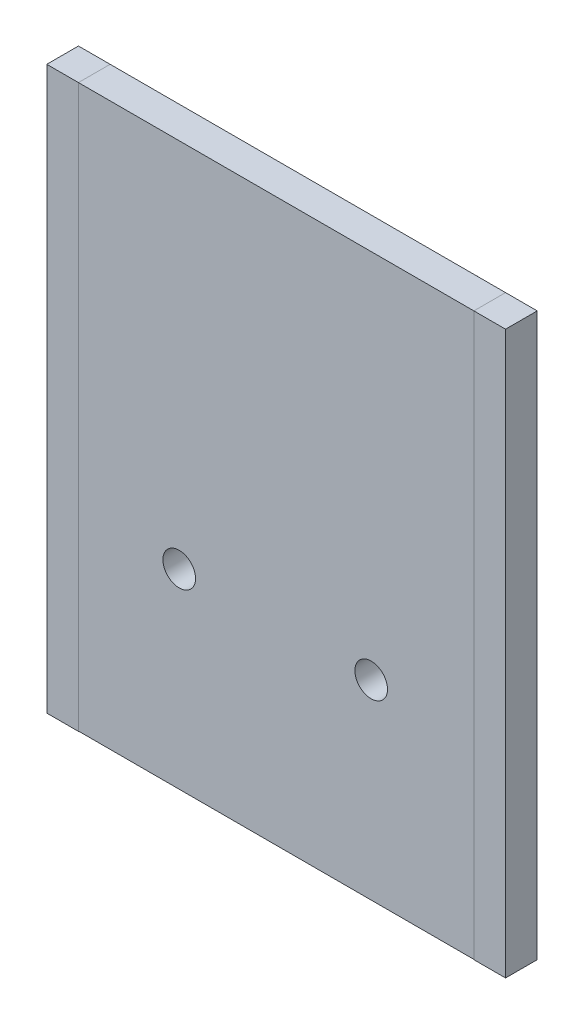
ISO-10303-21;
HEADER;
FILE_DESCRIPTION(('STEP AP214'),'2;1');
FILE_NAME('part.step','',(''),(''),'','','');
FILE_SCHEMA(('AUTOMOTIVE_DESIGN { 1 0 10303 214 1 1 1 1 }'));
ENDSEC;
DATA;
#1=APPLICATION_CONTEXT('core data for automotive mechanical design processes');
#2=APPLICATION_PROTOCOL_DEFINITION('international standard','automotive_design',2000,#1);
#3=PRODUCT_CONTEXT('',#1,'mechanical');
#4=PRODUCT('Part','Part','',(#3));
#5=PRODUCT_RELATED_PRODUCT_CATEGORY('part','',(#4));
#6=PRODUCT_DEFINITION_FORMATION('','',#4);
#7=PRODUCT_DEFINITION_CONTEXT('part definition',#1,'design');
#8=PRODUCT_DEFINITION('design','',#6,#7);
#9=PRODUCT_DEFINITION_SHAPE('','',#8);
#10=(LENGTH_UNIT() NAMED_UNIT(*) SI_UNIT(.MILLI.,.METRE.));
#11=(NAMED_UNIT(*) PLANE_ANGLE_UNIT() SI_UNIT($,.RADIAN.));
#12=(NAMED_UNIT(*) SI_UNIT($,.STERADIAN.) SOLID_ANGLE_UNIT());
#13=UNCERTAINTY_MEASURE_WITH_UNIT(LENGTH_MEASURE(1.E-05),#10,'distance_accuracy_value','');
#14=(GEOMETRIC_REPRESENTATION_CONTEXT(3) GLOBAL_UNCERTAINTY_ASSIGNED_CONTEXT((#13)) GLOBAL_UNIT_ASSIGNED_CONTEXT((#10,
#11,#12)) REPRESENTATION_CONTEXT('',''));
#15=CARTESIAN_POINT('',(0.,0.,0.));
#16=DIRECTION('',(0.,0.,1.));
#17=DIRECTION('',(1.,0.,0.));
#18=AXIS2_PLACEMENT_3D('',#15,#16,#17);
#19=CARTESIAN_POINT('',(-19.2738419618529,-28.655507896759,-3.3));
#20=DIRECTION('',(0.,1.,0.));
#21=DIRECTION('',(0.,0.,1.));
#22=AXIS2_PLACEMENT_3D('',#19,#20,#21);
#23=PLANE('',#22);
#24=DIRECTION('',(-1.,0.,0.));
#25=VECTOR('',#24,1.);
#26=CARTESIAN_POINT('',(-19.2738419618529,-28.655507896759,0.));
#27=LINE('',#26,#25);
#28=CARTESIAN_POINT('',(-19.2738419618529,-28.655507896759,0.));
#29=VERTEX_POINT('',#28);
#30=CARTESIAN_POINT('',(-22.5738419618529,-28.655507896759,0.));
#31=VERTEX_POINT('',#30);
#32=EDGE_CURVE('E13',#29,#31,#27,.T.);
#33=ORIENTED_EDGE('',*,*,#32,.T.);
#34=DIRECTION('',(0.,0.,1.));
#35=VECTOR('',#34,1.);
#36=CARTESIAN_POINT('',(-22.5738419618529,-28.655507896759,-3.3));
#37=LINE('',#36,#35);
#38=CARTESIAN_POINT('',(-22.5738419618529,-28.655507896759,-3.3));
#39=VERTEX_POINT('',#38);
#40=EDGE_CURVE('E111',#39,#31,#37,.T.);
#41=ORIENTED_EDGE('',*,*,#40,.F.);
#42=DIRECTION('',(-1.,0.,0.));
#43=VECTOR('',#42,1.);
#44=CARTESIAN_POINT('',(-19.2738419618529,-28.655507896759,-3.3));
#45=LINE('',#44,#43);
#46=CARTESIAN_POINT('',(-19.2738419618529,-28.655507896759,-3.3));
#47=VERTEX_POINT('',#46);
#48=EDGE_CURVE('E96',#47,#39,#45,.T.);
#49=ORIENTED_EDGE('',*,*,#48,.F.);
#50=DIRECTION('',(0.,0.,1.));
#51=VECTOR('',#50,1.);
#52=CARTESIAN_POINT('',(-19.2738419618529,-28.655507896759,-3.3));
#53=LINE('',#52,#51);
#54=EDGE_CURVE('E146',#47,#29,#53,.T.);
#55=ORIENTED_EDGE('',*,*,#54,.T.);
#56=EDGE_LOOP('',(#33,#41,#49,#55));
#57=FACE_BOUND('',#56,.T.);
#58=ADVANCED_FACE('F92',(#57),#23,.F.);
#59=CARTESIAN_POINT('',(-22.5738419618529,29.8889645776567,-3.3));
#60=DIRECTION('',(-1.,0.,0.));
#61=DIRECTION('',(0.,-1.,0.));
#62=AXIS2_PLACEMENT_3D('',#59,#60,#61);
#63=PLANE('',#62);
#64=DIRECTION('',(0.,-1.,0.));
#65=VECTOR('',#64,1.);
#66=CARTESIAN_POINT('',(-22.5738419618529,29.8889645776567,0.));
#67=LINE('',#66,#65);
#68=CARTESIAN_POINT('',(-22.5738419618529,29.8889645776567,0.));
#69=VERTEX_POINT('',#68);
#70=EDGE_CURVE('E102',#69,#31,#67,.T.);
#71=ORIENTED_EDGE('',*,*,#70,.F.);
#72=DIRECTION('',(0.,0.,1.));
#73=VECTOR('',#72,1.);
#74=CARTESIAN_POINT('',(-22.5738419618529,29.8889645776567,-3.3));
#75=LINE('',#74,#73);
#76=CARTESIAN_POINT('',(-22.5738419618529,29.8889645776567,-3.3));
#77=VERTEX_POINT('',#76);
#78=EDGE_CURVE('E124',#77,#69,#75,.T.);
#79=ORIENTED_EDGE('',*,*,#78,.F.);
#80=DIRECTION('',(0.,-1.,0.));
#81=VECTOR('',#80,1.);
#82=CARTESIAN_POINT('',(-22.5738419618529,29.8889645776567,-3.3));
#83=LINE('',#82,#81);
#84=EDGE_CURVE('E162',#77,#39,#83,.T.);
#85=ORIENTED_EDGE('',*,*,#84,.T.);
#86=ORIENTED_EDGE('',*,*,#40,.T.);
#87=EDGE_LOOP('',(#71,#79,#85,#86));
#88=FACE_BOUND('',#87,.T.);
#89=ADVANCED_FACE('F163',(#88),#63,.T.);
#90=CARTESIAN_POINT('',(-19.2738419618529,29.8889645776567,-3.3));
#91=DIRECTION('',(0.,1.,0.));
#92=DIRECTION('',(0.,0.,1.));
#93=AXIS2_PLACEMENT_3D('',#90,#91,#92);
#94=PLANE('',#93);
#95=DIRECTION('',(-1.,0.,0.));
#96=VECTOR('',#95,1.);
#97=CARTESIAN_POINT('',(-19.2738419618529,29.8889645776567,0.));
#98=LINE('',#97,#96);
#99=CARTESIAN_POINT('',(-19.2738419618529,29.8889645776567,0.));
#100=VERTEX_POINT('',#99);
#101=EDGE_CURVE('E153',#100,#69,#98,.T.);
#102=ORIENTED_EDGE('',*,*,#101,.F.);
#103=DIRECTION('',(0.,0.,1.));
#104=VECTOR('',#103,1.);
#105=CARTESIAN_POINT('',(-19.2738419618529,29.8889645776567,-3.3));
#106=LINE('',#105,#104);
#107=CARTESIAN_POINT('',(-19.2738419618529,29.8889645776567,-3.3));
#108=VERTEX_POINT('',#107);
#109=EDGE_CURVE('E139',#108,#100,#106,.T.);
#110=ORIENTED_EDGE('',*,*,#109,.F.);
#111=DIRECTION('',(-1.,0.,0.));
#112=VECTOR('',#111,1.);
#113=CARTESIAN_POINT('',(-19.2738419618529,29.8889645776567,-3.3));
#114=LINE('',#113,#112);
#115=EDGE_CURVE('E161',#108,#77,#114,.T.);
#116=ORIENTED_EDGE('',*,*,#115,.T.);
#117=ORIENTED_EDGE('',*,*,#78,.T.);
#118=EDGE_LOOP('',(#102,#110,#116,#117));
#119=FACE_BOUND('',#118,.T.);
#120=ADVANCED_FACE('F155',(#119),#94,.T.);
#121=CARTESIAN_POINT('',(-19.2738419618529,29.8889645776567,-3.3));
#122=DIRECTION('',(-1.,0.,0.));
#123=DIRECTION('',(0.,0.,1.));
#124=AXIS2_PLACEMENT_3D('',#121,#122,#123);
#125=PLANE('',#124);
#126=DIRECTION('',(0.,-1.,0.));
#127=VECTOR('',#126,1.);
#128=CARTESIAN_POINT('',(-19.2738419618529,29.8889645776567,0.));
#129=LINE('',#128,#127);
#130=EDGE_CURVE('E136',#100,#29,#129,.T.);
#131=ORIENTED_EDGE('',*,*,#130,.T.);
#132=ORIENTED_EDGE('',*,*,#54,.F.);
#133=DIRECTION('',(0.,-1.,0.));
#134=VECTOR('',#133,1.);
#135=CARTESIAN_POINT('',(-19.2738419618529,29.8889645776567,-3.3));
#136=LINE('',#135,#134);
#137=EDGE_CURVE('E141',#108,#47,#136,.T.);
#138=ORIENTED_EDGE('',*,*,#137,.F.);
#139=ORIENTED_EDGE('',*,*,#109,.T.);
#140=EDGE_LOOP('',(#131,#132,#138,#139));
#141=FACE_BOUND('',#140,.T.);
#142=ADVANCED_FACE('F140',(#141),#125,.F.);
#143=CARTESIAN_POINT('',(0.,0.,-3.3));
#144=DIRECTION('',(0.,0.,1.));
#145=DIRECTION('',(1.,0.,0.));
#146=AXIS2_PLACEMENT_3D('',#143,#144,#145);
#147=PLANE('',#146);
#148=ORIENTED_EDGE('',*,*,#48,.T.);
#149=ORIENTED_EDGE('',*,*,#84,.F.);
#150=ORIENTED_EDGE('',*,*,#115,.F.);
#151=ORIENTED_EDGE('',*,*,#137,.T.);
#152=EDGE_LOOP('',(#148,#149,#150,#151));
#153=FACE_BOUND('',#152,.T.);
#154=ADVANCED_FACE('F94',(#153),#147,.F.);
#155=CARTESIAN_POINT('',(0.,0.,0.));
#156=DIRECTION('',(0.,0.,1.));
#157=DIRECTION('',(1.,0.,0.));
#158=AXIS2_PLACEMENT_3D('',#155,#156,#157);
#159=PLANE('',#158);
#160=ORIENTED_EDGE('',*,*,#32,.F.);
#161=ORIENTED_EDGE('',*,*,#130,.F.);
#162=ORIENTED_EDGE('',*,*,#101,.T.);
#163=ORIENTED_EDGE('',*,*,#70,.T.);
#164=EDGE_LOOP('',(#160,#161,#162,#163));
#165=FACE_BOUND('',#164,.T.);
#166=ADVANCED_FACE('F151',(#165),#159,.T.);
#167=CLOSED_SHELL('',(#58,#89,#120,#142,#154,#166));
#168=MANIFOLD_SOLID_BREP('B2',#167);
#169=CARTESIAN_POINT('',(25.2261580381471,0.,-3.3));
#170=DIRECTION('',(-1.,0.,0.));
#171=DIRECTION('',(0.,-1.,0.));
#172=AXIS2_PLACEMENT_3D('',#169,#170,#171);
#173=PLANE('',#172);
#174=DIRECTION('',(0.,-1.,0.));
#175=VECTOR('',#174,1.);
#176=CARTESIAN_POINT('',(25.2261580381471,0.,0.));
#177=LINE('',#176,#175);
#178=CARTESIAN_POINT('',(25.2261580381471,29.8889645776567,0.));
#179=VERTEX_POINT('',#178);
#180=CARTESIAN_POINT('',(25.2261580381471,-28.655507896759,0.));
#181=VERTEX_POINT('',#180);
#182=EDGE_CURVE('E299',#179,#181,#177,.T.);
#183=ORIENTED_EDGE('',*,*,#182,.T.);
#184=DIRECTION('',(0.,0.,1.));
#185=VECTOR('',#184,1.);
#186=CARTESIAN_POINT('',(25.2261580381471,-28.655507896759,-3.3));
#187=LINE('',#186,#185);
#188=CARTESIAN_POINT('',(25.2261580381471,-28.655507896759,-3.3));
#189=VERTEX_POINT('',#188);
#190=EDGE_CURVE('E90',#189,#181,#187,.T.);
#191=ORIENTED_EDGE('',*,*,#190,.F.);
#192=DIRECTION('',(0.,-1.,0.));
#193=VECTOR('',#192,1.);
#194=CARTESIAN_POINT('',(25.2261580381471,0.,-3.3));
#195=LINE('',#194,#193);
#196=CARTESIAN_POINT('',(25.2261580381471,29.8889645776567,-3.3));
#197=VERTEX_POINT('',#196);
#198=EDGE_CURVE('E255',#197,#189,#195,.T.);
#199=ORIENTED_EDGE('',*,*,#198,.F.);
#200=DIRECTION('',(0.,0.,1.));
#201=VECTOR('',#200,1.);
#202=CARTESIAN_POINT('',(25.2261580381471,29.8889645776567,-3.3));
#203=LINE('',#202,#201);
#204=EDGE_CURVE('E240',#197,#179,#203,.T.);
#205=ORIENTED_EDGE('',*,*,#204,.T.);
#206=EDGE_LOOP('',(#183,#191,#199,#205));
#207=FACE_BOUND('',#206,.T.);
#208=ADVANCED_FACE('F237',(#207),#173,.F.);
#209=CARTESIAN_POINT('',(0.,-28.655507896759,-3.3));
#210=DIRECTION('',(0.,-1.,0.));
#211=DIRECTION('',(0.,0.,-1.));
#212=AXIS2_PLACEMENT_3D('',#209,#210,#211);
#213=PLANE('',#212);
#214=DIRECTION('',(1.,0.,0.));
#215=VECTOR('',#214,1.);
#216=CARTESIAN_POINT('',(0.,-28.655507896759,0.));
#217=LINE('',#216,#215);
#218=CARTESIAN_POINT('',(21.9261580381471,-28.655507896759,0.));
#219=VERTEX_POINT('',#218);
#220=EDGE_CURVE('E304',#219,#181,#217,.T.);
#221=ORIENTED_EDGE('',*,*,#220,.F.);
#222=DIRECTION('',(0.,0.,1.));
#223=VECTOR('',#222,1.);
#224=CARTESIAN_POINT('',(21.9261580381471,-28.655507896759,-3.3));
#225=LINE('',#224,#223);
#226=CARTESIAN_POINT('',(21.9261580381471,-28.655507896759,-3.3));
#227=VERTEX_POINT('',#226);
#228=EDGE_CURVE('E246',#227,#219,#225,.T.);
#229=ORIENTED_EDGE('',*,*,#228,.F.);
#230=DIRECTION('',(1.,0.,0.));
#231=VECTOR('',#230,1.);
#232=CARTESIAN_POINT('',(0.,-28.655507896759,-3.3));
#233=LINE('',#232,#231);
#234=EDGE_CURVE('E294',#227,#189,#233,.T.);
#235=ORIENTED_EDGE('',*,*,#234,.T.);
#236=ORIENTED_EDGE('',*,*,#190,.T.);
#237=EDGE_LOOP('',(#221,#229,#235,#236));
#238=FACE_BOUND('',#237,.T.);
#239=ADVANCED_FACE('F310',(#238),#213,.T.);
#240=CARTESIAN_POINT('',(21.9261580381471,0.,-3.3));
#241=DIRECTION('',(-1.,0.,0.));
#242=DIRECTION('',(0.,0.,1.));
#243=AXIS2_PLACEMENT_3D('',#240,#241,#242);
#244=PLANE('',#243);
#245=DIRECTION('',(0.,-1.,0.));
#246=VECTOR('',#245,1.);
#247=CARTESIAN_POINT('',(21.9261580381471,0.,0.));
#248=LINE('',#247,#246);
#249=CARTESIAN_POINT('',(21.9261580381471,29.8889645776567,0.));
#250=VERTEX_POINT('',#249);
#251=EDGE_CURVE('E287',#250,#219,#248,.T.);
#252=ORIENTED_EDGE('',*,*,#251,.F.);
#253=DIRECTION('',(0.,0.,1.));
#254=VECTOR('',#253,1.);
#255=CARTESIAN_POINT('',(21.9261580381471,29.8889645776567,-3.3));
#256=LINE('',#255,#254);
#257=CARTESIAN_POINT('',(21.9261580381471,29.8889645776567,-3.3));
#258=VERTEX_POINT('',#257);
#259=EDGE_CURVE('E284',#258,#250,#256,.T.);
#260=ORIENTED_EDGE('',*,*,#259,.F.);
#261=DIRECTION('',(0.,-1.,0.));
#262=VECTOR('',#261,1.);
#263=CARTESIAN_POINT('',(21.9261580381471,0.,-3.3));
#264=LINE('',#263,#262);
#265=EDGE_CURVE('E286',#258,#227,#264,.T.);
#266=ORIENTED_EDGE('',*,*,#265,.T.);
#267=ORIENTED_EDGE('',*,*,#228,.T.);
#268=EDGE_LOOP('',(#252,#260,#266,#267));
#269=FACE_BOUND('',#268,.T.);
#270=ADVANCED_FACE('F285',(#269),#244,.T.);
#271=CARTESIAN_POINT('',(0.,29.8889645776567,-3.3));
#272=DIRECTION('',(0.,-1.,0.));
#273=DIRECTION('',(0.,0.,-1.));
#274=AXIS2_PLACEMENT_3D('',#271,#272,#273);
#275=PLANE('',#274);
#276=DIRECTION('',(1.,0.,0.));
#277=VECTOR('',#276,1.);
#278=CARTESIAN_POINT('',(0.,29.8889645776567,0.));
#279=LINE('',#278,#277);
#280=EDGE_CURVE('E301',#250,#179,#279,.T.);
#281=ORIENTED_EDGE('',*,*,#280,.T.);
#282=ORIENTED_EDGE('',*,*,#204,.F.);
#283=DIRECTION('',(1.,0.,0.));
#284=VECTOR('',#283,1.);
#285=CARTESIAN_POINT('',(0.,29.8889645776567,-3.3));
#286=LINE('',#285,#284);
#287=EDGE_CURVE('E281',#258,#197,#286,.T.);
#288=ORIENTED_EDGE('',*,*,#287,.F.);
#289=ORIENTED_EDGE('',*,*,#259,.T.);
#290=EDGE_LOOP('',(#281,#282,#288,#289));
#291=FACE_BOUND('',#290,.T.);
#292=ADVANCED_FACE('F290',(#291),#275,.F.);
#293=CARTESIAN_POINT('',(0.,0.,-3.3));
#294=DIRECTION('',(0.,0.,1.));
#295=DIRECTION('',(1.,0.,0.));
#296=AXIS2_PLACEMENT_3D('',#293,#294,#295);
#297=PLANE('',#296);
#298=ORIENTED_EDGE('',*,*,#198,.T.);
#299=ORIENTED_EDGE('',*,*,#234,.F.);
#300=ORIENTED_EDGE('',*,*,#265,.F.);
#301=ORIENTED_EDGE('',*,*,#287,.T.);
#302=EDGE_LOOP('',(#298,#299,#300,#301));
#303=FACE_BOUND('',#302,.T.);
#304=ADVANCED_FACE('F293',(#303),#297,.F.);
#305=CARTESIAN_POINT('',(0.,0.,0.));
#306=DIRECTION('',(0.,0.,1.));
#307=DIRECTION('',(1.,0.,0.));
#308=AXIS2_PLACEMENT_3D('',#305,#306,#307);
#309=PLANE('',#308);
#310=ORIENTED_EDGE('',*,*,#182,.F.);
#311=ORIENTED_EDGE('',*,*,#280,.F.);
#312=ORIENTED_EDGE('',*,*,#251,.T.);
#313=ORIENTED_EDGE('',*,*,#220,.T.);
#314=EDGE_LOOP('',(#310,#311,#312,#313));
#315=FACE_BOUND('',#314,.T.);
#316=ADVANCED_FACE('F309',(#315),#309,.T.);
#317=CLOSED_SHELL('',(#208,#239,#270,#292,#304,#316));
#318=MANIFOLD_SOLID_BREP('B7',#317);
#319=CARTESIAN_POINT('',(0.,0.,-3.3));
#320=DIRECTION('',(0.,0.,-1.));
#321=DIRECTION('',(-1.,0.,0.));
#322=AXIS2_PLACEMENT_3D('',#319,#320,#321);
#323=PLANE('',#322);
#324=DIRECTION('',(0.,1.,0.));
#325=VECTOR('',#324,1.);
#326=CARTESIAN_POINT('',(21.9261580381471,28.7389645776567,-3.3));
#327=LINE('',#326,#325);
#328=CARTESIAN_POINT('',(21.9261580381471,-28.6267029972752,-3.3));
#329=VERTEX_POINT('',#328);
#330=CARTESIAN_POINT('',(21.9261580381471,29.8889645776567,-3.3));
#331=VERTEX_POINT('',#330);
#332=EDGE_CURVE('E392',#329,#331,#327,.T.);
#333=ORIENTED_EDGE('',*,*,#332,.F.);
#334=DIRECTION('',(-1.,0.,0.));
#335=VECTOR('',#334,1.);
#336=CARTESIAN_POINT('',(21.9261580381471,-28.6267029972752,-3.3));
#337=LINE('',#336,#335);
#338=CARTESIAN_POINT('',(-19.2738419618529,-28.6267029972752,-3.3));
#339=VERTEX_POINT('',#338);
#340=EDGE_CURVE('E423',#329,#339,#337,.T.);
#341=ORIENTED_EDGE('',*,*,#340,.T.);
#342=DIRECTION('',(0.,1.,0.));
#343=VECTOR('',#342,1.);
#344=CARTESIAN_POINT('',(-19.2738419618529,28.7389645776567,-3.3));
#345=LINE('',#344,#343);
#346=CARTESIAN_POINT('',(-19.2738419618529,29.8889645776567,-3.3));
#347=VERTEX_POINT('',#346);
#348=EDGE_CURVE('E419',#339,#347,#345,.T.);
#349=ORIENTED_EDGE('',*,*,#348,.T.);
#350=DIRECTION('',(1.,0.,0.));
#351=VECTOR('',#350,1.);
#352=CARTESIAN_POINT('',(-19.2738419618529,29.8889645776567,-3.3));
#353=LINE('',#352,#351);
#354=EDGE_CURVE('E417',#347,#331,#353,.T.);
#355=ORIENTED_EDGE('',*,*,#354,.T.);
#356=EDGE_LOOP('',(#333,#341,#349,#355));
#357=FACE_BOUND('',#356,.T.);
#358=CARTESIAN_POINT('',(11.2261580381471,-8.76103542234332,-3.3));
#359=DIRECTION('',(0.,0.,1.));
#360=DIRECTION('',(1.,0.,0.));
#361=AXIS2_PLACEMENT_3D('',#358,#359,#360);
#362=CIRCLE('',#361,1.7);
#363=CARTESIAN_POINT('',(12.9261580381471,-8.76103542234332,-3.3));
#364=VERTEX_POINT('',#363);
#365=EDGE_CURVE('E440',#364,#364,#362,.T.);
#366=ORIENTED_EDGE('',*,*,#365,.T.);
#367=EDGE_LOOP('',(#366));
#368=FACE_BOUND('',#367,.T.);
#369=CARTESIAN_POINT('',(-8.77384196185286,-8.76103542234332,-3.3));
#370=DIRECTION('',(0.,0.,-1.));
#371=DIRECTION('',(-1.,0.,0.));
#372=AXIS2_PLACEMENT_3D('',#369,#370,#371);
#373=CIRCLE('',#372,1.7);
#374=CARTESIAN_POINT('',(-10.4738419618529,-8.76103542234332,-3.3));
#375=VERTEX_POINT('',#374);
#376=EDGE_CURVE('E478',#375,#375,#373,.T.);
#377=ORIENTED_EDGE('',*,*,#376,.F.);
#378=EDGE_LOOP('',(#377));
#379=FACE_BOUND('',#378,.T.);
#380=ADVANCED_FACE('F373',(#357,#368,#379),#323,.T.);
#381=CARTESIAN_POINT('',(0.,0.,0.));
#382=DIRECTION('',(0.,0.,-1.));
#383=DIRECTION('',(-1.,0.,0.));
#384=AXIS2_PLACEMENT_3D('',#381,#382,#383);
#385=PLANE('',#384);
#386=CARTESIAN_POINT('',(11.2261580381471,-8.76103542234332,0.));
#387=DIRECTION('',(0.,0.,1.));
#388=DIRECTION('',(1.,0.,0.));
#389=AXIS2_PLACEMENT_3D('',#386,#387,#388);
#390=CIRCLE('',#389,1.7);
#391=CARTESIAN_POINT('',(12.9261580381471,-8.76103542234332,0.));
#392=VERTEX_POINT('',#391);
#393=EDGE_CURVE('E483',#392,#392,#390,.T.);
#394=ORIENTED_EDGE('',*,*,#393,.F.);
#395=EDGE_LOOP('',(#394));
#396=FACE_BOUND('',#395,.T.);
#397=DIRECTION('',(0.,-1.,0.));
#398=VECTOR('',#397,1.);
#399=CARTESIAN_POINT('',(21.9261580381471,28.7389645776567,0.));
#400=LINE('',#399,#398);
#401=CARTESIAN_POINT('',(21.9261580381471,29.8889645776567,0.));
#402=VERTEX_POINT('',#401);
#403=CARTESIAN_POINT('',(21.9261580381471,-28.6267029972752,0.));
#404=VERTEX_POINT('',#403);
#405=EDGE_CURVE('E413',#402,#404,#400,.T.);
#406=ORIENTED_EDGE('',*,*,#405,.F.);
#407=DIRECTION('',(1.,0.,0.));
#408=VECTOR('',#407,1.);
#409=CARTESIAN_POINT('',(-19.2738419618529,29.8889645776567,0.));
#410=LINE('',#409,#408);
#411=CARTESIAN_POINT('',(-19.2738419618529,29.8889645776567,0.));
#412=VERTEX_POINT('',#411);
#413=EDGE_CURVE('E438',#412,#402,#410,.T.);
#414=ORIENTED_EDGE('',*,*,#413,.F.);
#415=DIRECTION('',(0.,-1.,0.));
#416=VECTOR('',#415,1.);
#417=CARTESIAN_POINT('',(-19.2738419618529,28.7389645776567,0.));
#418=LINE('',#417,#416);
#419=CARTESIAN_POINT('',(-19.2738419618529,-28.6267029972752,0.));
#420=VERTEX_POINT('',#419);
#421=EDGE_CURVE('E429',#412,#420,#418,.T.);
#422=ORIENTED_EDGE('',*,*,#421,.T.);
#423=DIRECTION('',(-1.,0.,0.));
#424=VECTOR('',#423,1.);
#425=CARTESIAN_POINT('',(21.9261580381471,-28.6267029972752,0.));
#426=LINE('',#425,#424);
#427=EDGE_CURVE('E442',#404,#420,#426,.T.);
#428=ORIENTED_EDGE('',*,*,#427,.F.);
#429=EDGE_LOOP('',(#406,#414,#422,#428));
#430=FACE_BOUND('',#429,.T.);
#431=CARTESIAN_POINT('',(-8.77384196185286,-8.76103542234332,0.));
#432=DIRECTION('',(0.,0.,-1.));
#433=DIRECTION('',(-1.,0.,0.));
#434=AXIS2_PLACEMENT_3D('',#431,#432,#433);
#435=CIRCLE('',#434,1.7);
#436=CARTESIAN_POINT('',(-10.4738419618529,-8.76103542234332,0.));
#437=VERTEX_POINT('',#436);
#438=EDGE_CURVE('E481',#437,#437,#435,.T.);
#439=ORIENTED_EDGE('',*,*,#438,.T.);
#440=EDGE_LOOP('',(#439));
#441=FACE_BOUND('',#440,.T.);
#442=ADVANCED_FACE('F449',(#396,#430,#441),#385,.F.);
#443=CARTESIAN_POINT('',(21.9261580381471,28.7389645776567,-3.3));
#444=DIRECTION('',(-1.,0.,0.));
#445=DIRECTION('',(0.,-1.,0.));
#446=AXIS2_PLACEMENT_3D('',#443,#444,#445);
#447=PLANE('',#446);
#448=ORIENTED_EDGE('',*,*,#405,.T.);
#449=DIRECTION('',(0.,0.,1.));
#450=VECTOR('',#449,1.);
#451=CARTESIAN_POINT('',(21.9261580381471,-28.6267029972752,-3.3));
#452=LINE('',#451,#450);
#453=EDGE_CURVE('E235',#329,#404,#452,.T.);
#454=ORIENTED_EDGE('',*,*,#453,.F.);
#455=ORIENTED_EDGE('',*,*,#332,.T.);
#456=DIRECTION('',(0.,0.,1.));
#457=VECTOR('',#456,1.);
#458=CARTESIAN_POINT('',(21.9261580381471,29.8889645776567,-3.3));
#459=LINE('',#458,#457);
#460=EDGE_CURVE('E377',#331,#402,#459,.T.);
#461=ORIENTED_EDGE('',*,*,#460,.T.);
#462=EDGE_LOOP('',(#448,#454,#455,#461));
#463=FACE_BOUND('',#462,.T.);
#464=ADVANCED_FACE('F451',(#463),#447,.F.);
#465=CARTESIAN_POINT('',(21.9261580381471,-28.6267029972752,-3.3));
#466=DIRECTION('',(0.,1.,0.));
#467=DIRECTION('',(-1.,0.,0.));
#468=AXIS2_PLACEMENT_3D('',#465,#466,#467);
#469=PLANE('',#468);
#470=ORIENTED_EDGE('',*,*,#427,.T.);
#471=DIRECTION('',(0.,0.,1.));
#472=VECTOR('',#471,1.);
#473=CARTESIAN_POINT('',(-19.2738419618529,-28.6267029972752,-3.3));
#474=LINE('',#473,#472);
#475=EDGE_CURVE('E383',#339,#420,#474,.T.);
#476=ORIENTED_EDGE('',*,*,#475,.F.);
#477=ORIENTED_EDGE('',*,*,#340,.F.);
#478=ORIENTED_EDGE('',*,*,#453,.T.);
#479=EDGE_LOOP('',(#470,#476,#477,#478));
#480=FACE_BOUND('',#479,.T.);
#481=ADVANCED_FACE('F447',(#480),#469,.F.);
#482=CARTESIAN_POINT('',(-19.2738419618529,28.7389645776567,-3.3));
#483=DIRECTION('',(-1.,0.,0.));
#484=DIRECTION('',(0.,-1.,0.));
#485=AXIS2_PLACEMENT_3D('',#482,#483,#484);
#486=PLANE('',#485);
#487=ORIENTED_EDGE('',*,*,#421,.F.);
#488=DIRECTION('',(0.,0.,1.));
#489=VECTOR('',#488,1.);
#490=CARTESIAN_POINT('',(-19.2738419618529,29.8889645776567,-3.3));
#491=LINE('',#490,#489);
#492=EDGE_CURVE('E426',#347,#412,#491,.T.);
#493=ORIENTED_EDGE('',*,*,#492,.F.);
#494=ORIENTED_EDGE('',*,*,#348,.F.);
#495=ORIENTED_EDGE('',*,*,#475,.T.);
#496=EDGE_LOOP('',(#487,#493,#494,#495));
#497=FACE_BOUND('',#496,.T.);
#498=ADVANCED_FACE('F427',(#497),#486,.T.);
#499=CARTESIAN_POINT('',(-19.2738419618529,29.8889645776567,-3.3));
#500=DIRECTION('',(0.,-1.,0.));
#501=DIRECTION('',(0.,0.,-1.));
#502=AXIS2_PLACEMENT_3D('',#499,#500,#501);
#503=PLANE('',#502);
#504=ORIENTED_EDGE('',*,*,#413,.T.);
#505=ORIENTED_EDGE('',*,*,#460,.F.);
#506=ORIENTED_EDGE('',*,*,#354,.F.);
#507=ORIENTED_EDGE('',*,*,#492,.T.);
#508=EDGE_LOOP('',(#504,#505,#506,#507));
#509=FACE_BOUND('',#508,.T.);
#510=ADVANCED_FACE('F375',(#509),#503,.F.);
#511=CARTESIAN_POINT('',(11.2261580381471,-8.76103542234332,-3.3));
#512=DIRECTION('',(0.,0.,1.));
#513=DIRECTION('',(1.,0.,0.));
#514=AXIS2_PLACEMENT_3D('',#511,#512,#513);
#515=CYLINDRICAL_SURFACE('',#514,1.7);
#516=ORIENTED_EDGE('',*,*,#365,.F.);
#517=EDGE_LOOP('',(#516));
#518=FACE_BOUND('',#517,.T.);
#519=ORIENTED_EDGE('',*,*,#393,.T.);
#520=EDGE_LOOP('',(#519));
#521=FACE_BOUND('',#520,.T.);
#522=ADVANCED_FACE('F466',(#518,#521),#515,.F.);
#523=CARTESIAN_POINT('',(-8.77384196185286,-8.76103542234332,-3.3));
#524=DIRECTION('',(0.,0.,1.));
#525=DIRECTION('',(1.,0.,0.));
#526=AXIS2_PLACEMENT_3D('',#523,#524,#525);
#527=CYLINDRICAL_SURFACE('',#526,1.7);
#528=ORIENTED_EDGE('',*,*,#376,.T.);
#529=EDGE_LOOP('',(#528));
#530=FACE_BOUND('',#529,.T.);
#531=ORIENTED_EDGE('',*,*,#438,.F.);
#532=EDGE_LOOP('',(#531));
#533=FACE_BOUND('',#532,.T.);
#534=ADVANCED_FACE('F469',(#530,#533),#527,.F.);
#535=CLOSED_SHELL('',(#380,#442,#464,#481,#498,#510,#522,#534));
#536=MANIFOLD_SOLID_BREP('B84',#535);
#537=ADVANCED_BREP_SHAPE_REPRESENTATION('',(#18,#168,#318,#536),#14);
#538=SHAPE_DEFINITION_REPRESENTATION(#9,#537);
ENDSEC;
END-ISO-10303-21;
